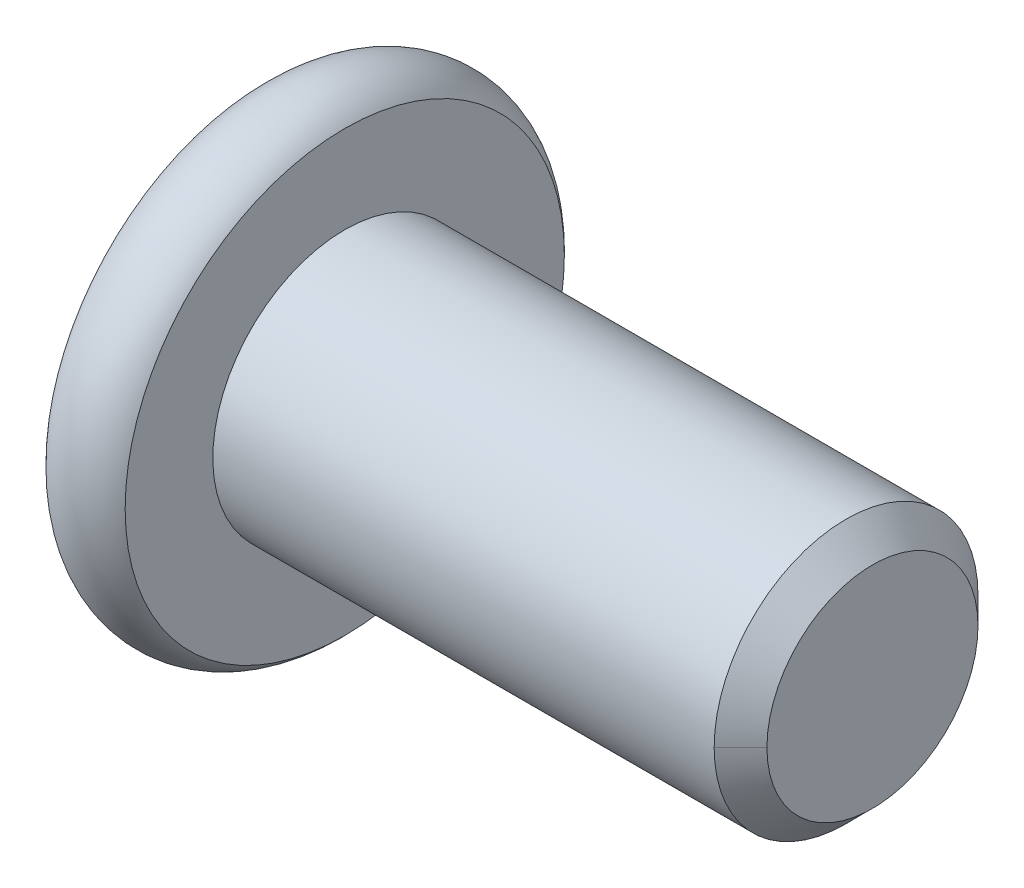
ISO-10303-21;
HEADER;
FILE_DESCRIPTION(('STEP AP214'),'2;1');
FILE_NAME('part.step','',(''),(''),'','','');
FILE_SCHEMA(('AUTOMOTIVE_DESIGN { 1 0 10303 214 1 1 1 1 }'));
ENDSEC;
DATA;
#1=APPLICATION_CONTEXT('core data for automotive mechanical design processes');
#2=APPLICATION_PROTOCOL_DEFINITION('international standard','automotive_design',2000,#1);
#3=PRODUCT_CONTEXT('',#1,'mechanical');
#4=PRODUCT('Part','Part','',(#3));
#5=PRODUCT_RELATED_PRODUCT_CATEGORY('part','',(#4));
#6=PRODUCT_DEFINITION_FORMATION('','',#4);
#7=PRODUCT_DEFINITION_CONTEXT('part definition',#1,'design');
#8=PRODUCT_DEFINITION('design','',#6,#7);
#9=PRODUCT_DEFINITION_SHAPE('','',#8);
#10=(LENGTH_UNIT() NAMED_UNIT(*) SI_UNIT(.MILLI.,.METRE.));
#11=(NAMED_UNIT(*) PLANE_ANGLE_UNIT() SI_UNIT($,.RADIAN.));
#12=(NAMED_UNIT(*) SI_UNIT($,.STERADIAN.) SOLID_ANGLE_UNIT());
#13=UNCERTAINTY_MEASURE_WITH_UNIT(LENGTH_MEASURE(1.E-05),#10,'distance_accuracy_value','');
#14=(GEOMETRIC_REPRESENTATION_CONTEXT(3) GLOBAL_UNCERTAINTY_ASSIGNED_CONTEXT((#13)) GLOBAL_UNIT_ASSIGNED_CONTEXT((#10,
#11,#12)) REPRESENTATION_CONTEXT('',''));
#15=CARTESIAN_POINT('',(0.,0.,0.));
#16=DIRECTION('',(0.,0.,1.));
#17=DIRECTION('',(1.,0.,0.));
#18=AXIS2_PLACEMENT_3D('',#15,#16,#17);
#19=CARTESIAN_POINT('',(-9.19999999999999,-1.11022302462516E-12,-9.43689570931383E-13));
#20=DIRECTION('',(-1.,0.,0.));
#21=DIRECTION('',(0.,-1.,0.));
#22=AXIS2_PLACEMENT_3D('',#19,#20,#21);
#23=PLANE('',#22);
#24=DIRECTION('',(0.,-0.500000000000007,-0.866025403784435));
#25=VECTOR('',#24,1.);
#26=CARTESIAN_POINT('',(-9.20000000000171,-1.73205080756977,-2.22044604925031E-12));
#27=LINE('',#26,#25);
#28=CARTESIAN_POINT('',(-9.20000000000178,-1.73205080756916,-1.72236408698279E-12));
#29=VERTEX_POINT('',#28);
#30=CARTESIAN_POINT('',(-9.20000000000082,-0.866025403786279,1.49999999999815));
#31=VERTEX_POINT('',#30);
#32=EDGE_CURVE('E112',#29,#31,#27,.F.);
#33=ORIENTED_EDGE('',*,*,#32,.T.);
#34=DIRECTION('',(0.,-1.,0.));
#35=VECTOR('',#34,1.);
#36=CARTESIAN_POINT('',(-9.20000000000037,-0.866025403784887,1.49999999999811));
#37=LINE('',#36,#35);
#38=CARTESIAN_POINT('',(-9.1999999999996,0.866025403783082,1.49999999999876));
#39=VERTEX_POINT('',#38);
#40=EDGE_CURVE('E185',#31,#39,#37,.F.);
#41=ORIENTED_EDGE('',*,*,#40,.T.);
#42=DIRECTION('',(0.,-0.499999999999988,0.866025403784446));
#43=VECTOR('',#42,1.);
#44=CARTESIAN_POINT('',(-9.19999999999921,0.866025403783333,1.49999999999867));
#45=LINE('',#44,#43);
#46=CARTESIAN_POINT('',(-9.19999999999939,1.73205080756769,-2.00448391829456E-12));
#47=VERTEX_POINT('',#46);
#48=EDGE_CURVE('E179',#39,#47,#45,.F.);
#49=ORIENTED_EDGE('',*,*,#48,.T.);
#50=DIRECTION('',(0.,0.500000000000007,0.866025403784435));
#51=VECTOR('',#50,1.);
#52=CARTESIAN_POINT('',(-9.19999999999949,1.732050807568,-1.27675647831893E-12));
#53=LINE('',#52,#51);
#54=CARTESIAN_POINT('',(-9.19999999999965,0.866025403783649,-1.50000000000112));
#55=VERTEX_POINT('',#54);
#56=EDGE_CURVE('E165',#47,#55,#53,.F.);
#57=ORIENTED_EDGE('',*,*,#56,.T.);
#58=DIRECTION('',(0.,1.,0.));
#59=VECTOR('',#58,1.);
#60=CARTESIAN_POINT('',(-9.19999999999999,0.866025403783777,-1.50000000000117));
#61=LINE('',#60,#59);
#62=CARTESIAN_POINT('',(-9.20000000000121,-0.866025403784922,-1.50000000000108));
#63=VERTEX_POINT('',#62);
#64=EDGE_CURVE('E178',#55,#63,#61,.F.);
#65=ORIENTED_EDGE('',*,*,#64,.T.);
#66=DIRECTION('',(0.,0.499999999999988,-0.866025403784446));
#67=VECTOR('',#66,1.);
#68=CARTESIAN_POINT('',(-9.20000000000182,-0.866025403784665,-1.50000000000172));
#69=LINE('',#68,#67);
#70=EDGE_CURVE('E117',#63,#29,#69,.F.);
#71=ORIENTED_EDGE('',*,*,#70,.T.);
#72=EDGE_LOOP('',(#33,#41,#49,#57,#65,#71));
#73=FACE_BOUND('',#72,.T.);
#74=ADVANCED_FACE('F16',(#73),#23,.T.);
#75=CARTESIAN_POINT('',(-9.20000000000171,-1.73205080756977,-2.22044604925031E-12));
#76=DIRECTION('',(0.,-0.866025403784435,0.500000000000007));
#77=DIRECTION('',(0.,-0.500000000000007,-0.866025403784435));
#78=AXIS2_PLACEMENT_3D('',#75,#76,#77);
#79=PLANE('',#78);
#80=CARTESIAN_POINT('',(-11.4500000000187,-1.73205080753657,2.89421639222001E-11));
#81=CARTESIAN_POINT('',(-11.420262849598,-1.70228509139985,0.0515557327182752));
#82=CARTESIAN_POINT('',(-11.3922725003774,-1.67202169202726,0.103973478048275));
#83=CARTESIAN_POINT('',(-11.3410233658593,-1.6103115150037,0.210858640002246));
#84=CARTESIAN_POINT('',(-11.3177930862458,-1.5788588719184,0.265336215856443));
#85=CARTESIAN_POINT('',(-11.2779994610808,-1.51543615955045,0.375187576030208));
#86=CARTESIAN_POINT('',(-11.2613361227585,-1.48348223341732,0.430533399594574));
#87=CARTESIAN_POINT('',(-11.2356630756743,-1.41887111209505,0.542443144459105));
#88=CARTESIAN_POINT('',(-11.2266342101396,-1.38621588926078,0.599003649540398));
#89=CARTESIAN_POINT('',(-11.2184874106908,-1.32993158335365,0.696490927040221));
#90=CARTESIAN_POINT('',(-11.217281882483,-1.30637515271643,0.737291861748887));
#91=CARTESIAN_POINT('',(-11.2193161382012,-1.25930390223547,0.818821659157716));
#92=CARTESIAN_POINT('',(-11.2225569040841,-1.23578909273221,0.859550503947663));
#93=CARTESIAN_POINT('',(-11.2332973053055,-1.18898594447413,0.940615934684838));
#94=CARTESIAN_POINT('',(-11.2408009009096,-1.16569783682246,0.980952120349655));
#95=CARTESIAN_POINT('',(-11.2596594735921,-1.11951251256308,1.06094744853095));
#96=CARTESIAN_POINT('',(-11.2710161032843,-1.09661546812081,1.10060629284813));
#97=CARTESIAN_POINT('',(-11.3047185777232,-1.03798926281102,1.20214985909964));
#98=CARTESIAN_POINT('',(-11.3296009747124,-1.00262309537091,1.2634058579749));
#99=CARTESIAN_POINT('',(-11.371603712324,-0.950621031898972,1.35347607400671));
#100=CARTESIAN_POINT('',(-11.3863606331493,-0.933484737544254,1.38315700648254));
#101=CARTESIAN_POINT('',(-11.4172214999426,-0.899527124740223,1.44197331716287));
#102=CARTESIAN_POINT('',(-11.4333248049557,-0.882705661029168,1.4711089469681));
#103=CARTESIAN_POINT('',(-11.449999964656,-0.866025439163147,1.49999993872156));
#104=B_SPLINE_CURVE_WITH_KNOTS('',3,(#80,#81,#82,#83,#84,#85,#86,#87,#88,#89,#90,#91,#92,#93,
#94,#95,#96,#97,#98,#99,#100,#101,#102,#103),.UNSPECIFIED.,.F.,.F.,(4,2,2,2,2,2,2,2,2,2,2,4),
(0.,0.199774419657667,0.400712311772651,0.598459989986548,0.795709985508188,0.936894690696007,
1.07811058131814,1.21945787975104,1.36086588058144,1.58533905999253,1.69726358778265,
1.80913513330307),.UNSPECIFIED.);
#105=CARTESIAN_POINT('',(-11.449999999972,-1.73205080753868,-1.82146791882532E-12));
#106=VERTEX_POINT('',#105);
#107=CARTESIAN_POINT('',(-11.4499999823456,-0.866025421474861,1.49999996936011));
#108=VERTEX_POINT('',#107);
#109=EDGE_CURVE('E19',#106,#108,#104,.T.);
#110=ORIENTED_EDGE('',*,*,#109,.T.);
#111=DIRECTION('',(1.,0.,0.));
#112=VECTOR('',#111,1.);
#113=CARTESIAN_POINT('',(-9.20000000000037,-0.866025403786885,1.49999999999811));
#114=LINE('',#113,#112);
#115=EDGE_CURVE('E182',#108,#31,#114,.T.);
#116=ORIENTED_EDGE('',*,*,#115,.T.);
#117=ORIENTED_EDGE('',*,*,#32,.F.);
#118=DIRECTION('',(1.,0.,0.));
#119=VECTOR('',#118,1.);
#120=CARTESIAN_POINT('',(-9.20000000000182,-1.73205080756903,-1.79348723372552E-12));
#121=LINE('',#120,#119);
#122=EDGE_CURVE('E106',#29,#106,#121,.F.);
#123=ORIENTED_EDGE('',*,*,#122,.T.);
#124=EDGE_LOOP('',(#110,#116,#117,#123));
#125=FACE_BOUND('',#124,.T.);
#126=ADVANCED_FACE('F108',(#125),#79,.F.);
#127=CARTESIAN_POINT('',(-9.20000000000037,-0.866025403784887,1.49999999999811));
#128=DIRECTION('',(0.,0.,1.));
#129=DIRECTION('',(0.,-1.,0.));
#130=AXIS2_PLACEMENT_3D('',#127,#128,#129);
#131=PLANE('',#130);
#132=CARTESIAN_POINT('',(-11.4500000205211,-0.866025411177076,1.4999999693679));
#133=CARTESIAN_POINT('',(-11.4202628611136,-0.806493983106405,1.49999998897657));
#134=CARTESIAN_POINT('',(-11.3922725080077,-0.745967186228508,1.4999999970387));
#135=CARTESIAN_POINT('',(-11.3410233702206,-0.622546834035319,1.50000000297475));
#136=CARTESIAN_POINT('',(-11.3177930912347,-0.559641547845246,1.50000000078907));
#137=CARTESIAN_POINT('',(-11.2779994659595,-0.432796123814653,1.4999999992197));
#138=CARTESIAN_POINT('',(-11.2613361269042,-0.368888272269812,1.49999999979207));
#139=CARTESIAN_POINT('',(-11.2356630784399,-0.239666030795439,1.5000000002036));
#140=CARTESIAN_POINT('',(-11.2266342122674,-0.174355585574135,1.50000000004459));
#141=CARTESIAN_POINT('',(-11.2184874115153,-0.0617869746049953,1.49999999996481));
#142=CARTESIAN_POINT('',(-11.2172818826925,-0.0146741137420389,1.49999999998917));
#143=CARTESIAN_POINT('',(-11.2193161371295,0.0794683864571236,1.50000000000701));
#144=CARTESIAN_POINT('',(-11.2225569023455,0.126498005112424,1.50000000000048));
#145=CARTESIAN_POINT('',(-11.233297302211,0.220104301040396,1.49999999999569));
#146=CARTESIAN_POINT('',(-11.240800897131,0.266680516106238,1.49999999999743));
#147=CARTESIAN_POINT('',(-11.2596594684655,0.359051164198352,1.49999999999873));
#148=CARTESIAN_POINT('',(-11.2710160974936,0.404845252893761,1.49999999999829));
#149=CARTESIAN_POINT('',(-11.3047185715035,0.522097667368082,1.49999999999775));
#150=CARTESIAN_POINT('',(-11.3296009692616,0.59283000617427,1.49999999999801));
#151=CARTESIAN_POINT('',(-11.3716037085773,0.696834138741628,1.49999999999811));
#152=CARTESIAN_POINT('',(-11.3863606300522,0.73110672926157,1.49999999999809));
#153=CARTESIAN_POINT('',(-11.4172214982918,0.799021958419109,1.49999999999805));
#154=CARTESIAN_POINT('',(-11.4333248041014,0.83266488758033,1.49999999999804));
#155=CARTESIAN_POINT('',(-11.4499999646558,0.86602533302344,1.49999999999807));
#156=B_SPLINE_CURVE_WITH_KNOTS('',3,(#132,#133,#134,#135,#136,#137,#138,#139,#140,#141,#142,
#143,#144,#145,#146,#147,#148,#149,#150,#151,#152,#153,#154,#155),.UNSPECIFIED.,.F.,.F.,(4,2,2,
2,2,2,2,2,2,2,2,4),(0.,0.199774419422548,0.400712310711187,0.598459987552085,0.795709981958974,
0.936894685979579,1.07811057541151,1.21945787281463,1.36086587261299,1.58533906380351,
1.6972635973504,1.80913514860487),.UNSPECIFIED.);
#157=CARTESIAN_POINT('',(-11.4499999823463,0.86602536840353,1.49999999999859));
#158=VERTEX_POINT('',#157);
#159=EDGE_CURVE('E136',#108,#158,#156,.T.);
#160=ORIENTED_EDGE('',*,*,#159,.T.);
#161=DIRECTION('',(1.,0.,0.));
#162=VECTOR('',#161,1.);
#163=CARTESIAN_POINT('',(-9.19999999999921,0.866025403783083,1.4999999999991));
#164=LINE('',#163,#162);
#165=EDGE_CURVE('E174',#158,#39,#164,.T.);
#166=ORIENTED_EDGE('',*,*,#165,.T.);
#167=ORIENTED_EDGE('',*,*,#40,.F.);
#168=ORIENTED_EDGE('',*,*,#115,.F.);
#169=EDGE_LOOP('',(#160,#166,#167,#168));
#170=FACE_BOUND('',#169,.T.);
#171=ADVANCED_FACE('F281',(#170),#131,.F.);
#172=CARTESIAN_POINT('',(-9.19999999999921,0.866025403783333,1.49999999999867));
#173=DIRECTION('',(0.,0.866025403784446,0.499999999999988));
#174=DIRECTION('',(0.,-0.499999999999988,0.866025403784446));
#175=AXIS2_PLACEMENT_3D('',#172,#173,#174);
#176=PLANE('',#175);
#177=CARTESIAN_POINT('',(-11.4500000205241,0.86602537355986,1.49999999108513));
#178=CARTESIAN_POINT('',(-11.4202628610863,0.895791104607278,1.44844427180501));
#179=CARTESIAN_POINT('',(-11.3922725079536,0.926054510059641,1.39602653207619));
#180=CARTESIAN_POINT('',(-11.3410233701244,0.987764691361598,1.28914137458936));
#181=CARTESIAN_POINT('',(-11.3177930911232,1.01921733259696,1.23466379756597));
#182=CARTESIAN_POINT('',(-11.2779994658733,1.08264004325703,1.12481243721017));
#183=CARTESIAN_POINT('',(-11.2613361268461,1.11459396949381,1.06946661461156));
#184=CARTESIAN_POINT('',(-11.2356630784232,1.17920509052297,0.957556871078141));
#185=CARTESIAN_POINT('',(-11.2266342122643,1.21186031296286,0.900996366361768));
#186=CARTESIAN_POINT('',(-11.2184874115187,1.26814461833328,0.803509089631916));
#187=CARTESIAN_POINT('',(-11.2172818826953,1.29170104877407,0.762708155312226));
#188=CARTESIAN_POINT('',(-11.2193161371268,1.33877229886546,0.681178358613831));
#189=CARTESIAN_POINT('',(-11.2225569023378,1.3622871081756,0.640449514145311));
#190=CARTESIAN_POINT('',(-11.2332973021947,1.40909025613556,0.559384083914919));
#191=CARTESIAN_POINT('',(-11.2408008971153,1.43237836368172,0.519047898436332));
#192=CARTESIAN_POINT('',(-11.2596594684551,1.47856368775229,0.439052570584683));
#193=CARTESIAN_POINT('',(-11.271016097488,1.50146073211124,0.399393726410921));
#194=CARTESIAN_POINT('',(-11.3047185751565,1.5600869457123,0.297850145797431));
#195=CARTESIAN_POINT('',(-11.3296009780527,1.59545312125759,0.236594132884104));
#196=CARTESIAN_POINT('',(-11.3716037264621,1.64745519638315,0.146523896667832));
#197=CARTESIAN_POINT('',(-11.3863606511903,1.6645914945212,0.116842957639037));
#198=CARTESIAN_POINT('',(-11.4172215262947,1.69854911474699,0.058026634103778));
#199=CARTESIAN_POINT('',(-11.4333248357151,1.71537058209672,0.0288909979961525));
#200=CARTESIAN_POINT('',(-11.450000000015,1.73205080754622,3.59733126069946E-11));
#201=B_SPLINE_CURVE_WITH_KNOTS('',3,(#177,#178,#179,#180,#181,#182,#183,#184,#185,#186,#187,
#188,#189,#190,#191,#192,#193,#194,#195,#196,#197,#198,#199,#200),.UNSPECIFIED.,.F.,.F.,(4,2,2,
2,2,2,2,2,2,2,2,4),(0.,0.199774419625038,0.400712311115703,0.598459987754344,0.795709981960857,
0.936894685911056,1.07811057527153,1.21945787274337,1.36086587261542,1.5853391034421,
1.69726365670454,1.80913522761487),.UNSPECIFIED.);
#202=CARTESIAN_POINT('',(-11.4500000000486,1.73205080758246,1.66108903885912E-11));
#203=VERTEX_POINT('',#202);
#204=EDGE_CURVE('E266',#158,#203,#201,.T.);
#205=ORIENTED_EDGE('',*,*,#204,.T.);
#206=DIRECTION('',(1.,0.,0.));
#207=VECTOR('',#206,1.);
#208=CARTESIAN_POINT('',(-9.19999999999949,1.73205080756752,-2.10045377872181E-12));
#209=LINE('',#208,#207);
#210=EDGE_CURVE('E138',#203,#47,#209,.T.);
#211=ORIENTED_EDGE('',*,*,#210,.T.);
#212=ORIENTED_EDGE('',*,*,#48,.F.);
#213=ORIENTED_EDGE('',*,*,#165,.F.);
#214=EDGE_LOOP('',(#205,#211,#212,#213));
#215=FACE_BOUND('',#214,.T.);
#216=ADVANCED_FACE('F275',(#215),#176,.F.);
#217=CARTESIAN_POINT('',(-9.19999999999999,0.866025403783777,-1.50000000000117));
#218=DIRECTION('',(0.,0.,-1.));
#219=DIRECTION('',(0.,1.,0.));
#220=AXIS2_PLACEMENT_3D('',#217,#218,#219);
#221=PLANE('',#220);
#222=CARTESIAN_POINT('',(-11.4499999646679,0.866025333021934,-1.49999999999491));
#223=CARTESIAN_POINT('',(-11.4202628181556,0.806493904924935,-1.49999999999892));
#224=CARTESIAN_POINT('',(-11.392272472781,0.745967110477302,-1.50000000000056));
#225=CARTESIAN_POINT('',(-11.3410233456093,0.622546765450342,-1.50000000000177));
#226=CARTESIAN_POINT('',(-11.3177930694868,0.559641484006999,-1.50000000000132));
#227=CARTESIAN_POINT('',(-11.2779994505229,0.432796068974162,-1.500000000001));
#228=CARTESIAN_POINT('',(-11.2613361149283,0.368888221675363,-1.50000000000112));
#229=CARTESIAN_POINT('',(-11.2356630722066,0.23966598928669,-1.5000000000012));
#230=CARTESIAN_POINT('',(-11.2266342083139,0.174355548904674,-1.50000000000116));
#231=CARTESIAN_POINT('',(-11.2184874102318,0.0617869426574615,-1.50000000000114));
#232=CARTESIAN_POINT('',(-11.2172818824265,0.0146740816002054,-1.50000000000115));
#233=CARTESIAN_POINT('',(-11.219316138901,-0.0794684188927512,-1.50000000000115));
#234=CARTESIAN_POINT('',(-11.222556905138,-0.126498037647504,-1.50000000000115));
#235=CARTESIAN_POINT('',(-11.2332973070032,-0.220104333665731,-1.50000000000114));
#236=CARTESIAN_POINT('',(-11.2408009028995,-0.266680548722549,-1.50000000000114));
#237=CARTESIAN_POINT('',(-11.2596594760968,-0.359051196736772,-1.50000000000114));
#238=CARTESIAN_POINT('',(-11.2710161060113,-0.404845285363281,-1.50000000000114));
#239=CARTESIAN_POINT('',(-11.3047185805558,-0.522097693987691,-1.50000000000114));
#240=CARTESIAN_POINT('',(-11.3296009772212,-0.592830027174879,-1.50000000000114));
#241=CARTESIAN_POINT('',(-11.3716037140865,-0.696834151642433,-1.50000000000113));
#242=CARTESIAN_POINT('',(-11.3863606346112,-0.731106739520675,-1.50000000000113));
#243=CARTESIAN_POINT('',(-11.4172215007353,-0.799021963498935,-1.50000000000113));
#244=CARTESIAN_POINT('',(-11.43332480538,-0.832664890122381,-1.50000000000113));
#245=CARTESIAN_POINT('',(-11.4499999646852,-0.866025333068806,-1.50000000000113));
#246=B_SPLINE_CURVE_WITH_KNOTS('',3,(#222,#223,#224,#225,#226,#227,#228,#229,#230,#231,#232,
#233,#234,#235,#236,#237,#238,#239,#240,#241,#242,#243,#244,#245),.UNSPECIFIED.,.F.,.F.,(4,2,2,
2,2,2,2,2,2,2,2,4),(0.,0.199774403133942,0.400712278349219,0.598459940144335,0.79570991941144,
0.936894623917034,1.07811051386372,1.21945781171085,1.36086581195455,1.58533898629356,
1.69726351143806,1.80913505432179),.UNSPECIFIED.);
#247=CARTESIAN_POINT('',(-11.4500000035712,0.866025400257726,-1.50000000610819));
#248=VERTEX_POINT('',#247);
#249=CARTESIAN_POINT('',(-11.4499999823642,-0.866025368426838,-1.50000000000105));
#250=VERTEX_POINT('',#249);
#251=EDGE_CURVE('E129',#248,#250,#246,.T.);
#252=ORIENTED_EDGE('',*,*,#251,.T.);
#253=DIRECTION('',(1.,0.,0.));
#254=VECTOR('',#253,1.);
#255=CARTESIAN_POINT('',(-9.20000000000182,-0.866025403785092,-1.50000000000098));
#256=LINE('',#255,#254);
#257=EDGE_CURVE('E116',#250,#63,#256,.T.);
#258=ORIENTED_EDGE('',*,*,#257,.T.);
#259=ORIENTED_EDGE('',*,*,#64,.F.);
#260=DIRECTION('',(1.,0.,0.));
#261=VECTOR('',#260,1.);
#262=CARTESIAN_POINT('',(-9.19999999999949,0.866025403783649,-1.50000000000109));
#263=LINE('',#262,#261);
#264=EDGE_CURVE('E160',#55,#248,#263,.F.);
#265=ORIENTED_EDGE('',*,*,#264,.T.);
#266=EDGE_LOOP('',(#252,#258,#259,#265));
#267=FACE_BOUND('',#266,.T.);
#268=ADVANCED_FACE('F272',(#267),#221,.F.);
#269=CARTESIAN_POINT('',(-9.20000000000182,-0.866025403784665,-1.50000000000172));
#270=DIRECTION('',(0.,-0.866025403784446,-0.499999999999988));
#271=DIRECTION('',(0.,0.499999999999988,-0.866025403784446));
#272=AXIS2_PLACEMENT_3D('',#269,#270,#271);
#273=PLANE('',#272);
#274=CARTESIAN_POINT('',(-11.4500000205257,-0.866025373573926,-1.49999999110992));
#275=CARTESIAN_POINT('',(-11.420262861094,-0.895791104616406,-1.44844427181028));
#276=CARTESIAN_POINT('',(-11.3922725079642,-0.926054510070195,-1.39602653206745));
#277=CARTESIAN_POINT('',(-11.3410233701389,-0.9877646913807,-1.28914137455732));
#278=CARTESIAN_POINT('',(-11.3177930911385,-1.01921733262322,-1.23466379752467));
#279=CARTESIAN_POINT('',(-11.2779994658932,-1.08264004329589,-1.12481243714928));
#280=CARTESIAN_POINT('',(-11.2613361268693,-1.11459396953814,-1.06946661454038));
#281=CARTESIAN_POINT('',(-11.235663078455,-1.1792050905784,-0.957556870987153));
#282=CARTESIAN_POINT('',(-11.2266342123011,-1.21186031302391,-0.900996366261269));
#283=CARTESIAN_POINT('',(-11.2184874115649,-1.26814461840615,-0.803509089511049));
#284=CARTESIAN_POINT('',(-11.2172818827462,-1.29170104885328,-0.76270815518034));
#285=CARTESIAN_POINT('',(-11.2193161371883,-1.33877229895713,-0.681178358460349));
#286=CARTESIAN_POINT('',(-11.2225569024053,-1.36228710827339,-0.640449513981254));
#287=CARTESIAN_POINT('',(-11.2332973022752,-1.40909025624525,-0.559384083730254));
#288=CARTESIAN_POINT('',(-11.2408008972028,-1.43237836379719,-0.519047898241636));
#289=CARTESIAN_POINT('',(-11.2596594685573,-1.47856368787907,-0.439052570370388));
#290=CARTESIAN_POINT('',(-11.2710160975979,-1.50146073224356,-0.399393726187059));
#291=CARTESIAN_POINT('',(-11.3047185752672,-1.56008694582528,-0.297850145607042));
#292=CARTESIAN_POINT('',(-11.329600978149,-1.59545312134668,-0.236594132735111));
#293=CARTESIAN_POINT('',(-11.3716037265294,-1.64745519643803,-0.14652389657808));
#294=CARTESIAN_POINT('',(-11.3863606512466,-1.66459149456493,-0.1168429575686));
#295=CARTESIAN_POINT('',(-11.417221526327,-1.69854911476896,-0.0580266340710231));
#296=CARTESIAN_POINT('',(-11.4333248357345,-1.71537058210808,-0.0288909979817675));
#297=CARTESIAN_POINT('',(-11.4500000000207,-1.7320508075472,-3.95879154137329E-11));
#298=B_SPLINE_CURVE_WITH_KNOTS('',3,(#274,#275,#276,#277,#278,#279,#280,#281,#282,#283,#284,
#285,#286,#287,#288,#289,#290,#291,#292,#293,#294,#295,#296,#297),.UNSPECIFIED.,.F.,.F.,(4,2,2,
2,2,2,2,2,2,2,2,4),(0.,0.199774419656285,0.400712311178737,0.598459987848349,0.79570998208558,
0.936894686073457,1.07811057547166,1.21945787298115,1.36086587289085,1.58533910356928,
1.69726365675729,1.8091352275935),.UNSPECIFIED.);
#299=EDGE_CURVE('E121',#250,#106,#298,.T.);
#300=ORIENTED_EDGE('',*,*,#299,.T.);
#301=ORIENTED_EDGE('',*,*,#122,.F.);
#302=ORIENTED_EDGE('',*,*,#70,.F.);
#303=ORIENTED_EDGE('',*,*,#257,.F.);
#304=EDGE_LOOP('',(#300,#301,#302,#303));
#305=FACE_BOUND('',#304,.T.);
#306=ADVANCED_FACE('F122',(#305),#273,.F.);
#307=CARTESIAN_POINT('',(-9.19999999999949,1.732050807568,-1.27675647831893E-12));
#308=DIRECTION('',(0.,0.866025403784435,-0.500000000000007));
#309=DIRECTION('',(0.,0.500000000000007,0.866025403784435));
#310=AXIS2_PLACEMENT_3D('',#307,#308,#309);
#311=PLANE('',#310);
#312=CARTESIAN_POINT('',(-11.4500000000277,1.7320508075357,-3.86723683266536E-11));
#313=CARTESIAN_POINT('',(-11.4202628495742,1.70228509135652,-0.051555732796569));
#314=CARTESIAN_POINT('',(-11.3922725003245,1.6720216919415,-0.103973478198018));
#315=CARTESIAN_POINT('',(-11.3410233657619,1.610311514832,-0.210858640299338));
#316=CARTESIAN_POINT('',(-11.317793086133,1.57885887170319,-0.265336216229446));
#317=CARTESIAN_POINT('',(-11.2779994610042,1.515436159321,-0.375187576428276));
#318=CARTESIAN_POINT('',(-11.2613361227184,1.48348223321953,-0.430533399937678));
#319=CARTESIAN_POINT('',(-11.2356630756918,1.4188711119629,-0.542443144688389));
#320=CARTESIAN_POINT('',(-11.2266342101782,1.38621588916263,-0.599003649710848));
#321=CARTESIAN_POINT('',(-11.2184874107461,1.3299315832973,-0.696490927138299));
#322=CARTESIAN_POINT('',(-11.2172818825421,1.30637515266752,-0.737291861834063));
#323=CARTESIAN_POINT('',(-11.2193161382641,1.25930390220178,-0.818821659216535));
#324=CARTESIAN_POINT('',(-11.2225569041469,1.23578909270628,-0.859550503993029));
#325=CARTESIAN_POINT('',(-11.2332973053708,1.18898594443627,-0.94061593475087));
#326=CARTESIAN_POINT('',(-11.2408009009824,1.16569783676519,-0.980952120449308));
#327=CARTESIAN_POINT('',(-11.2596594736853,1.11951251246733,-1.06094744869725));
#328=CARTESIAN_POINT('',(-11.2710161033904,1.09661546800601,-1.10060629304743));
#329=CARTESIAN_POINT('',(-11.3047185820911,1.03798925530229,-1.2021498721056));
#330=CARTESIAN_POINT('',(-11.3296009850504,1.00262308073182,-1.263405883331));
#331=CARTESIAN_POINT('',(-11.371603733225,0.950621006995073,-1.35347611714199));
#332=CARTESIAN_POINT('',(-11.3863606578286,0.933484709299071,-1.3831570554051));
#333=CARTESIAN_POINT('',(-11.4172215325939,0.899527089939067,-1.44197337744071));
#334=CARTESIAN_POINT('',(-11.4333248417998,0.882705623013107,-1.47110901281431));
#335=CARTESIAN_POINT('',(-11.450000005849,0.866025397979974,-1.50000001005338));
#336=B_SPLINE_CURVE_WITH_KNOTS('',3,(#312,#313,#314,#315,#316,#317,#318,#319,#320,#321,#322,
#323,#324,#325,#326,#327,#328,#329,#330,#331,#332,#333,#334,#335),.UNSPECIFIED.,.F.,.F.,(4,2,2,
2,2,2,2,2,2,2,2,4),(0.,0.199774419919141,0.400712312295138,0.598459990298239,0.795709985611225,
0.936894690754264,1.07811058133044,1.21945787988067,1.3608658808342,1.5853391062654,
1.69726365694574,1.80913522528717),.UNSPECIFIED.);
#337=EDGE_CURVE('E151',#203,#248,#336,.T.);
#338=ORIENTED_EDGE('',*,*,#337,.T.);
#339=ORIENTED_EDGE('',*,*,#264,.F.);
#340=ORIENTED_EDGE('',*,*,#56,.F.);
#341=ORIENTED_EDGE('',*,*,#210,.F.);
#342=EDGE_LOOP('',(#338,#339,#340,#341));
#343=FACE_BOUND('',#342,.T.);
#344=ADVANCED_FACE('F249',(#343),#311,.F.);
#345=CARTESIAN_POINT('',(-11.4999999998986,-2.66453525910038E-12,-1.88737914186262E-12));
#346=DIRECTION('',(-1.,0.,0.));
#347=DIRECTION('',(0.,-1.,0.));
#348=AXIS2_PLACEMENT_3D('',#345,#346,#347);
#349=CONICAL_SURFACE('',#348,1.78205080743243,0.785398163397449);
#350=ORIENTED_EDGE('',*,*,#204,.F.);
#351=ORIENTED_EDGE('',*,*,#159,.F.);
#352=ORIENTED_EDGE('',*,*,#109,.F.);
#353=DIRECTION('',(0.707106781186547,0.707106781186548,0.));
#354=VECTOR('',#353,1.);
#355=CARTESIAN_POINT('',(-499000.,-498990.282050808,-1.2073748232038E-08));
#356=LINE('',#355,#354);
#357=CARTESIAN_POINT('',(-11.4999999999581,-1.78205080749461,-1.9284034030434E-12));
#358=VERTEX_POINT('',#357);
#359=EDGE_CURVE('E128',#106,#358,#356,.F.);
#360=ORIENTED_EDGE('',*,*,#359,.T.);
#361=CARTESIAN_POINT('',(-11.4999999999581,-2.66453525910029E-12,-1.8873791418627E-12));
#362=DIRECTION('',(-1.,0.,0.));
#363=DIRECTION('',(0.,-1.,0.));
#364=AXIS2_PLACEMENT_3D('',#361,#362,#363);
#365=CIRCLE('',#364,1.78205080749194);
#366=CARTESIAN_POINT('',(-11.4999999999581,1.78205080748928,-1.52425933993265E-12));
#367=VERTEX_POINT('',#366);
#368=EDGE_CURVE('E232',#367,#358,#365,.F.);
#369=ORIENTED_EDGE('',*,*,#368,.F.);
#370=DIRECTION('',(0.707106781186545,-0.70710678118655,0.));
#371=VECTOR('',#370,1.);
#372=CARTESIAN_POINT('',(-498999.999999999,498990.282050809,1.06455719111921E-08));
#373=LINE('',#372,#371);
#374=EDGE_CURVE('E145',#367,#203,#373,.T.);
#375=ORIENTED_EDGE('',*,*,#374,.T.);
#376=EDGE_LOOP('',(#350,#351,#352,#360,#369,#375));
#377=FACE_BOUND('',#376,.T.);
#378=ADVANCED_FACE('F134',(#377),#349,.F.);
#379=CARTESIAN_POINT('',(-11.4999999998986,-2.66453525910038E-12,-1.88737914186262E-12));
#380=DIRECTION('',(-1.,0.,0.));
#381=DIRECTION('',(0.,-1.,0.));
#382=AXIS2_PLACEMENT_3D('',#379,#380,#381);
#383=CONICAL_SURFACE('',#382,1.78205080743243,0.785398163497532);
#384=ORIENTED_EDGE('',*,*,#374,.F.);
#385=CARTESIAN_POINT('',(-11.4999999999581,-2.66453525910029E-12,-1.8873791418627E-12));
#386=DIRECTION('',(-1.,0.,0.));
#387=DIRECTION('',(0.,-1.,0.));
#388=AXIS2_PLACEMENT_3D('',#385,#386,#387);
#389=CIRCLE('',#388,1.78205080749194);
#390=EDGE_CURVE('E142',#358,#367,#389,.F.);
#391=ORIENTED_EDGE('',*,*,#390,.F.);
#392=ORIENTED_EDGE('',*,*,#359,.F.);
#393=ORIENTED_EDGE('',*,*,#299,.F.);
#394=ORIENTED_EDGE('',*,*,#251,.F.);
#395=ORIENTED_EDGE('',*,*,#337,.F.);
#396=EDGE_LOOP('',(#384,#391,#392,#393,#394,#395));
#397=FACE_BOUND('',#396,.T.);
#398=ADVANCED_FACE('F140',(#397),#383,.F.);
#399=CARTESIAN_POINT('',(-11.5,-2.66453525910038E-12,-1.88737914186277E-12));
#400=DIRECTION('',(-1.,0.,0.));
#401=DIRECTION('',(0.,-1.,0.));
#402=AXIS2_PLACEMENT_3D('',#399,#400,#401);
#403=PLANE('',#402);
#404=CARTESIAN_POINT('',(-11.5,-3.33301128242993E-12,-2.44360704532043E-12));
#405=DIRECTION('',(1.,0.,0.));
#406=DIRECTION('',(0.,1.,0.));
#407=AXIS2_PLACEMENT_3D('',#404,#405,#406);
#408=CIRCLE('',#407,4.16143782776609);
#409=CARTESIAN_POINT('',(-11.5,4.16143782776276,-2.44360704532043E-12));
#410=VERTEX_POINT('',#409);
#411=EDGE_CURVE('E226',#410,#410,#408,.T.);
#412=ORIENTED_EDGE('',*,*,#411,.F.);
#413=EDGE_LOOP('',(#412));
#414=FACE_BOUND('',#413,.T.);
#415=ORIENTED_EDGE('',*,*,#368,.T.);
#416=ORIENTED_EDGE('',*,*,#390,.T.);
#417=EDGE_LOOP('',(#415,#416));
#418=FACE_BOUND('',#417,.T.);
#419=ADVANCED_FACE('F254',(#414,#418),#403,.T.);
#420=CARTESIAN_POINT('',(-10.7499999999999,-3.33066907387547E-12,-2.44249065417534E-12));
#421=DIRECTION('',(1.,0.,0.));
#422=DIRECTION('',(0.,1.,0.));
#423=AXIS2_PLACEMENT_3D('',#420,#421,#422);
#424=TOROIDAL_SURFACE('',#423,3.5,1.);
#425=ORIENTED_EDGE('',*,*,#411,.T.);
#426=EDGE_LOOP('',(#425));
#427=FACE_BOUND('',#426,.T.);
#428=CARTESIAN_POINT('',(-10.0000000000023,-3.32832686532102E-12,-2.44137426303026E-12));
#429=DIRECTION('',(1.,0.,0.));
#430=DIRECTION('',(0.,1.,0.));
#431=AXIS2_PLACEMENT_3D('',#428,#429,#430);
#432=CIRCLE('',#431,4.16143782776886);
#433=CARTESIAN_POINT('',(-10.0000000000023,4.16143782776553,-2.44137426303026E-12));
#434=VERTEX_POINT('',#433);
#435=EDGE_CURVE('E218',#434,#434,#432,.T.);
#436=ORIENTED_EDGE('',*,*,#435,.F.);
#437=EDGE_LOOP('',(#436));
#438=FACE_BOUND('',#437,.T.);
#439=ADVANCED_FACE('F334',(#427,#438),#424,.T.);
#440=CARTESIAN_POINT('',(-0.499999999931329,0.,0.));
#441=DIRECTION('',(-1.,0.,0.));
#442=DIRECTION('',(0.,-1.,0.));
#443=AXIS2_PLACEMENT_3D('',#440,#441,#442);
#444=CONICAL_SURFACE('',#443,2.4999999998272,0.78539816339745);
#445=CARTESIAN_POINT('',(-0.499999999999945,-2.63999946846366E-12,-9.85059767658204E-13));
#446=DIRECTION('',(1.,0.,0.));
#447=DIRECTION('',(0.,1.,0.));
#448=AXIS2_PLACEMENT_3D('',#445,#446,#447);
#449=CIRCLE('',#448,2.49999999999997);
#450=CARTESIAN_POINT('',(-0.499999999988431,-1.92993534372752E-12,2.49999999995603));
#451=VERTEX_POINT('',#450);
#452=CARTESIAN_POINT('',(-0.499999999996267,-1.21376603533446E-12,-2.49999999997172));
#453=VERTEX_POINT('',#452);
#454=EDGE_CURVE('E217',#451,#453,#449,.F.);
#455=ORIENTED_EDGE('',*,*,#454,.F.);
#456=DIRECTION('',(0.70710678118655,0.,-0.707106781186545));
#457=VECTOR('',#456,1.);
#458=CARTESIAN_POINT('',(-498998.000000004,1.05945581335278E-08,499000.));
#459=LINE('',#458,#457);
#460=CARTESIAN_POINT('',(-8.52623635756722E-11,0.,1.99999999998113));
#461=VERTEX_POINT('',#460);
#462=EDGE_CURVE('E225',#451,#461,#459,.T.);
#463=ORIENTED_EDGE('',*,*,#462,.T.);
#464=CARTESIAN_POINT('',(-1.1368391037575E-10,0.,0.));
#465=DIRECTION('',(-1.,0.,0.));
#466=DIRECTION('',(0.,-1.,0.));
#467=AXIS2_PLACEMENT_3D('',#464,#465,#466);
#468=CIRCLE('',#467,2.00000000000955);
#469=CARTESIAN_POINT('',(-8.52607264303916E-11,0.,-2.00000000000955));
#470=VERTEX_POINT('',#469);
#471=EDGE_CURVE('E222',#470,#461,#468,.F.);
#472=ORIENTED_EDGE('',*,*,#471,.F.);
#473=DIRECTION('',(0.707106781186548,0.,0.707106781186547));
#474=VECTOR('',#473,1.);
#475=CARTESIAN_POINT('',(-498998.000000003,-1.46621909116545E-08,-499000.000000001));
#476=LINE('',#475,#474);
#477=EDGE_CURVE('E40',#470,#453,#476,.F.);
#478=ORIENTED_EDGE('',*,*,#477,.T.);
#479=EDGE_LOOP('',(#455,#463,#472,#478));
#480=FACE_BOUND('',#479,.T.);
#481=ADVANCED_FACE('F331',(#480),#444,.T.);
#482=CARTESIAN_POINT('',(0.,0.,0.));
#483=DIRECTION('',(1.,0.,0.));
#484=DIRECTION('',(0.,1.,0.));
#485=AXIS2_PLACEMENT_3D('',#482,#483,#484);
#486=PLANE('',#485);
#487=CARTESIAN_POINT('',(0.,0.,0.));
#488=DIRECTION('',(-1.,0.,0.));
#489=DIRECTION('',(0.,-1.,0.));
#490=AXIS2_PLACEMENT_3D('',#487,#488,#489);
#491=CIRCLE('',#490,1.99999999989586);
#492=EDGE_CURVE('E214',#470,#461,#491,.T.);
#493=ORIENTED_EDGE('',*,*,#492,.F.);
#494=ORIENTED_EDGE('',*,*,#471,.T.);
#495=EDGE_LOOP('',(#493,#494));
#496=FACE_BOUND('',#495,.T.);
#497=ADVANCED_FACE('F327',(#496),#486,.T.);
#498=CARTESIAN_POINT('',(-10.0000000000023,4.16143782776524,-1.83186799063151E-12));
#499=DIRECTION('',(1.,0.,0.));
#500=DIRECTION('',(0.,1.,0.));
#501=AXIS2_PLACEMENT_3D('',#498,#499,#500);
#502=PLANE('',#501);
#503=ORIENTED_EDGE('',*,*,#435,.T.);
#504=EDGE_LOOP('',(#503));
#505=FACE_BOUND('',#504,.T.);
#506=CARTESIAN_POINT('',(-10.,-2.66453525910038E-12,-9.99200722162641E-13));
#507=DIRECTION('',(1.,0.,0.));
#508=DIRECTION('',(0.,1.,0.));
#509=AXIS2_PLACEMENT_3D('',#506,#507,#508);
#510=CIRCLE('',#509,2.49999999999997);
#511=CARTESIAN_POINT('',(-10.,2.4999999999973,-9.99200722162641E-13));
#512=VERTEX_POINT('',#511);
#513=EDGE_CURVE('E31',#512,#512,#510,.T.);
#514=ORIENTED_EDGE('',*,*,#513,.F.);
#515=EDGE_LOOP('',(#514));
#516=FACE_BOUND('',#515,.T.);
#517=ADVANCED_FACE('F320',(#505,#516),#502,.T.);
#518=CARTESIAN_POINT('',(-0.499999999988173,0.,0.));
#519=DIRECTION('',(-1.,0.,0.));
#520=DIRECTION('',(0.,-1.,0.));
#521=AXIS2_PLACEMENT_3D('',#518,#519,#520);
#522=CONICAL_SURFACE('',#521,2.49999999994088,0.785398163454293);
#523=ORIENTED_EDGE('',*,*,#462,.F.);
#524=CARTESIAN_POINT('',(-0.499999999999952,-2.63999946846366E-12,-9.85059767658204E-13));
#525=DIRECTION('',(1.,0.,0.));
#526=DIRECTION('',(0.,1.,0.));
#527=AXIS2_PLACEMENT_3D('',#524,#525,#526);
#528=CIRCLE('',#527,2.49999999999997);
#529=EDGE_CURVE('E11',#453,#451,#528,.F.);
#530=ORIENTED_EDGE('',*,*,#529,.F.);
#531=ORIENTED_EDGE('',*,*,#477,.F.);
#532=ORIENTED_EDGE('',*,*,#492,.T.);
#533=EDGE_LOOP('',(#523,#530,#531,#532));
#534=FACE_BOUND('',#533,.T.);
#535=ADVANCED_FACE('F313',(#534),#522,.T.);
#536=CARTESIAN_POINT('',(-10.,-2.66453525910038E-12,-9.99200722162641E-13));
#537=DIRECTION('',(1.,0.,0.));
#538=DIRECTION('',(0.,1.,0.));
#539=AXIS2_PLACEMENT_3D('',#536,#537,#538);
#540=CYLINDRICAL_SURFACE('',#539,2.49999999999997);
#541=ORIENTED_EDGE('',*,*,#513,.T.);
#542=EDGE_LOOP('',(#541));
#543=FACE_BOUND('',#542,.T.);
#544=ORIENTED_EDGE('',*,*,#529,.T.);
#545=ORIENTED_EDGE('',*,*,#454,.T.);
#546=EDGE_LOOP('',(#544,#545));
#547=FACE_BOUND('',#546,.T.);
#548=ADVANCED_FACE('F311',(#543,#547),#540,.T.);
#549=CLOSED_SHELL('',(#74,#126,#171,#216,#268,#306,#344,#378,#398,#419,#439,#481,#497,#517,#535,#548));
#550=MANIFOLD_SOLID_BREP('B1',#549);
#551=ADVANCED_BREP_SHAPE_REPRESENTATION('',(#18,#550),#14);
#552=SHAPE_DEFINITION_REPRESENTATION(#9,#551);
ENDSEC;
END-ISO-10303-21;
